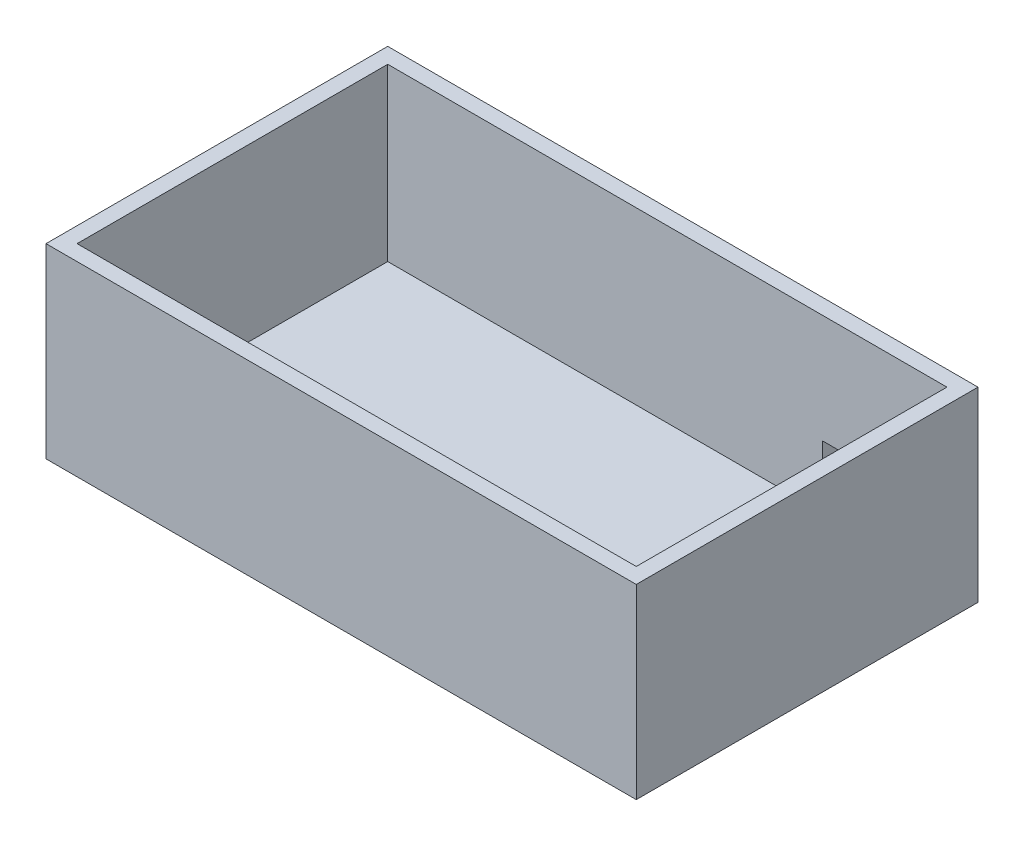
ISO-10303-21;
HEADER;
FILE_DESCRIPTION(('STEP AP214'),'2;1');
FILE_NAME('part.step','',(''),(''),'','','');
FILE_SCHEMA(('AUTOMOTIVE_DESIGN { 1 0 10303 214 1 1 1 1 }'));
ENDSEC;
DATA;
#1=APPLICATION_CONTEXT('core data for automotive mechanical design processes');
#2=APPLICATION_PROTOCOL_DEFINITION('international standard','automotive_design',2000,#1);
#3=PRODUCT_CONTEXT('',#1,'mechanical');
#4=PRODUCT('Part','Part','',(#3));
#5=PRODUCT_RELATED_PRODUCT_CATEGORY('part','',(#4));
#6=PRODUCT_DEFINITION_FORMATION('','',#4);
#7=PRODUCT_DEFINITION_CONTEXT('part definition',#1,'design');
#8=PRODUCT_DEFINITION('design','',#6,#7);
#9=PRODUCT_DEFINITION_SHAPE('','',#8);
#10=(LENGTH_UNIT() NAMED_UNIT(*) SI_UNIT(.MILLI.,.METRE.));
#11=(NAMED_UNIT(*) PLANE_ANGLE_UNIT() SI_UNIT($,.RADIAN.));
#12=(NAMED_UNIT(*) SI_UNIT($,.STERADIAN.) SOLID_ANGLE_UNIT());
#13=UNCERTAINTY_MEASURE_WITH_UNIT(LENGTH_MEASURE(1.E-05),#10,'distance_accuracy_value','');
#14=(GEOMETRIC_REPRESENTATION_CONTEXT(3) GLOBAL_UNCERTAINTY_ASSIGNED_CONTEXT((#13)) GLOBAL_UNIT_ASSIGNED_CONTEXT((#10,
#11,#12)) REPRESENTATION_CONTEXT('',''));
#15=CARTESIAN_POINT('',(0.,0.,0.));
#16=DIRECTION('',(0.,0.,1.));
#17=DIRECTION('',(1.,0.,0.));
#18=AXIS2_PLACEMENT_3D('',#15,#16,#17);
#19=CARTESIAN_POINT('',(0.,60.,0.));
#20=DIRECTION('',(0.,-1.,0.));
#21=DIRECTION('',(0.,0.,-1.));
#22=AXIS2_PLACEMENT_3D('',#19,#20,#21);
#23=PLANE('',#22);
#24=DIRECTION('',(0.,0.,1.));
#25=VECTOR('',#24,1.);
#26=CARTESIAN_POINT('',(-5.,60.,5.));
#27=LINE('',#26,#25);
#28=CARTESIAN_POINT('',(-5.,60.,-105.));
#29=VERTEX_POINT('',#28);
#30=CARTESIAN_POINT('',(-5.,60.,5.));
#31=VERTEX_POINT('',#30);
#32=EDGE_CURVE('E214',#29,#31,#27,.T.);
#33=ORIENTED_EDGE('',*,*,#32,.T.);
#34=DIRECTION('',(1.,0.,0.));
#35=VECTOR('',#34,1.);
#36=CARTESIAN_POINT('',(-5.,60.,5.));
#37=LINE('',#36,#35);
#38=CARTESIAN_POINT('',(185.,60.,5.));
#39=VERTEX_POINT('',#38);
#40=EDGE_CURVE('E218',#31,#39,#37,.T.);
#41=ORIENTED_EDGE('',*,*,#40,.T.);
#42=DIRECTION('',(0.,0.,-1.));
#43=VECTOR('',#42,1.);
#44=CARTESIAN_POINT('',(185.,60.,5.));
#45=LINE('',#44,#43);
#46=CARTESIAN_POINT('',(185.,60.,-105.));
#47=VERTEX_POINT('',#46);
#48=EDGE_CURVE('E222',#39,#47,#45,.T.);
#49=ORIENTED_EDGE('',*,*,#48,.T.);
#50=DIRECTION('',(-1.,0.,0.));
#51=VECTOR('',#50,1.);
#52=CARTESIAN_POINT('',(-5.,60.,-105.));
#53=LINE('',#52,#51);
#54=EDGE_CURVE('E225',#47,#29,#53,.T.);
#55=ORIENTED_EDGE('',*,*,#54,.T.);
#56=EDGE_LOOP('',(#33,#41,#49,#55));
#57=FACE_BOUND('',#56,.T.);
#58=DIRECTION('',(0.,0.,1.));
#59=VECTOR('',#58,1.);
#60=CARTESIAN_POINT('',(0.,60.,0.));
#61=LINE('',#60,#59);
#62=CARTESIAN_POINT('',(0.,60.,-100.));
#63=VERTEX_POINT('',#62);
#64=CARTESIAN_POINT('',(0.,60.,0.));
#65=VERTEX_POINT('',#64);
#66=EDGE_CURVE('E184',#63,#65,#61,.T.);
#67=ORIENTED_EDGE('',*,*,#66,.F.);
#68=DIRECTION('',(-1.,0.,0.));
#69=VECTOR('',#68,1.);
#70=CARTESIAN_POINT('',(0.,60.,-100.));
#71=LINE('',#70,#69);
#72=CARTESIAN_POINT('',(180.,60.,-100.));
#73=VERTEX_POINT('',#72);
#74=EDGE_CURVE('E194',#73,#63,#71,.T.);
#75=ORIENTED_EDGE('',*,*,#74,.F.);
#76=DIRECTION('',(0.,0.,-1.));
#77=VECTOR('',#76,1.);
#78=CARTESIAN_POINT('',(180.,60.,0.));
#79=LINE('',#78,#77);
#80=CARTESIAN_POINT('',(180.,60.,0.));
#81=VERTEX_POINT('',#80);
#82=EDGE_CURVE('E190',#81,#73,#79,.T.);
#83=ORIENTED_EDGE('',*,*,#82,.F.);
#84=DIRECTION('',(1.,0.,0.));
#85=VECTOR('',#84,1.);
#86=CARTESIAN_POINT('',(0.,60.,0.));
#87=LINE('',#86,#85);
#88=EDGE_CURVE('E187',#65,#81,#87,.T.);
#89=ORIENTED_EDGE('',*,*,#88,.F.);
#90=EDGE_LOOP('',(#67,#75,#83,#89));
#91=FACE_BOUND('',#90,.T.);
#92=ADVANCED_FACE('F43',(#57,#91),#23,.F.);
#93=CARTESIAN_POINT('',(0.,0.,0.));
#94=DIRECTION('',(0.,-1.,0.));
#95=DIRECTION('',(0.,0.,-1.));
#96=AXIS2_PLACEMENT_3D('',#93,#94,#95);
#97=PLANE('',#96);
#98=DIRECTION('',(0.,0.,1.));
#99=VECTOR('',#98,1.);
#100=CARTESIAN_POINT('',(-5.,0.,5.));
#101=LINE('',#100,#99);
#102=CARTESIAN_POINT('',(-5.,0.,-105.));
#103=VERTEX_POINT('',#102);
#104=CARTESIAN_POINT('',(-5.,0.,5.));
#105=VERTEX_POINT('',#104);
#106=EDGE_CURVE('E213',#103,#105,#101,.T.);
#107=ORIENTED_EDGE('',*,*,#106,.F.);
#108=DIRECTION('',(-1.,0.,0.));
#109=VECTOR('',#108,1.);
#110=CARTESIAN_POINT('',(-5.,0.,-105.));
#111=LINE('',#110,#109);
#112=CARTESIAN_POINT('',(185.,0.,-105.));
#113=VERTEX_POINT('',#112);
#114=EDGE_CURVE('E219',#113,#103,#111,.T.);
#115=ORIENTED_EDGE('',*,*,#114,.F.);
#116=DIRECTION('',(0.,0.,-1.));
#117=VECTOR('',#116,1.);
#118=CARTESIAN_POINT('',(185.,0.,5.));
#119=LINE('',#118,#117);
#120=CARTESIAN_POINT('',(185.,0.,5.));
#121=VERTEX_POINT('',#120);
#122=EDGE_CURVE('E236',#121,#113,#119,.T.);
#123=ORIENTED_EDGE('',*,*,#122,.F.);
#124=DIRECTION('',(1.,0.,0.));
#125=VECTOR('',#124,1.);
#126=CARTESIAN_POINT('',(-5.,0.,5.));
#127=LINE('',#126,#125);
#128=EDGE_CURVE('E232',#105,#121,#127,.T.);
#129=ORIENTED_EDGE('',*,*,#128,.F.);
#130=EDGE_LOOP('',(#107,#115,#123,#129));
#131=FACE_BOUND('',#130,.T.);
#132=ADVANCED_FACE('F289',(#131),#97,.T.);
#133=CARTESIAN_POINT('',(-5.,60.,5.));
#134=DIRECTION('',(1.,0.,0.));
#135=DIRECTION('',(0.,0.,-1.));
#136=AXIS2_PLACEMENT_3D('',#133,#134,#135);
#137=PLANE('',#136);
#138=DIRECTION('',(0.,-1.,0.));
#139=VECTOR('',#138,1.);
#140=CARTESIAN_POINT('',(-5.,60.,-105.));
#141=LINE('',#140,#139);
#142=EDGE_CURVE('E228',#29,#103,#141,.T.);
#143=ORIENTED_EDGE('',*,*,#142,.T.);
#144=ORIENTED_EDGE('',*,*,#106,.T.);
#145=DIRECTION('',(0.,-1.,0.));
#146=VECTOR('',#145,1.);
#147=CARTESIAN_POINT('',(-5.,60.,5.));
#148=LINE('',#147,#146);
#149=EDGE_CURVE('E251',#31,#105,#148,.T.);
#150=ORIENTED_EDGE('',*,*,#149,.F.);
#151=ORIENTED_EDGE('',*,*,#32,.F.);
#152=EDGE_LOOP('',(#143,#144,#150,#151));
#153=FACE_BOUND('',#152,.T.);
#154=ADVANCED_FACE('F45',(#153),#137,.F.);
#155=CARTESIAN_POINT('',(-5.,60.,5.));
#156=DIRECTION('',(0.,0.,-1.));
#157=DIRECTION('',(-1.,0.,0.));
#158=AXIS2_PLACEMENT_3D('',#155,#156,#157);
#159=PLANE('',#158);
#160=ORIENTED_EDGE('',*,*,#149,.T.);
#161=ORIENTED_EDGE('',*,*,#128,.T.);
#162=DIRECTION('',(0.,-1.,0.));
#163=VECTOR('',#162,1.);
#164=CARTESIAN_POINT('',(185.,60.,5.));
#165=LINE('',#164,#163);
#166=EDGE_CURVE('E248',#39,#121,#165,.T.);
#167=ORIENTED_EDGE('',*,*,#166,.F.);
#168=ORIENTED_EDGE('',*,*,#40,.F.);
#169=EDGE_LOOP('',(#160,#161,#167,#168));
#170=FACE_BOUND('',#169,.T.);
#171=ADVANCED_FACE('F304',(#170),#159,.F.);
#172=CARTESIAN_POINT('',(185.,60.,5.));
#173=DIRECTION('',(-1.,0.,0.));
#174=DIRECTION('',(0.,0.,1.));
#175=AXIS2_PLACEMENT_3D('',#172,#173,#174);
#176=PLANE('',#175);
#177=ORIENTED_EDGE('',*,*,#166,.T.);
#178=ORIENTED_EDGE('',*,*,#122,.T.);
#179=DIRECTION('',(0.,-1.,0.));
#180=VECTOR('',#179,1.);
#181=CARTESIAN_POINT('',(185.,60.,-105.));
#182=LINE('',#181,#180);
#183=EDGE_CURVE('E245',#47,#113,#182,.T.);
#184=ORIENTED_EDGE('',*,*,#183,.F.);
#185=ORIENTED_EDGE('',*,*,#48,.F.);
#186=EDGE_LOOP('',(#177,#178,#184,#185));
#187=FACE_BOUND('',#186,.T.);
#188=ADVANCED_FACE('F302',(#187),#176,.F.);
#189=CARTESIAN_POINT('',(-5.,60.,-105.));
#190=DIRECTION('',(0.,0.,1.));
#191=DIRECTION('',(1.,0.,0.));
#192=AXIS2_PLACEMENT_3D('',#189,#190,#191);
#193=PLANE('',#192);
#194=DIRECTION('',(-1.,0.,0.));
#195=VECTOR('',#194,1.);
#196=CARTESIAN_POINT('',(165.,5.,-105.));
#197=LINE('',#196,#195);
#198=CARTESIAN_POINT('',(165.,5.,-105.));
#199=VERTEX_POINT('',#198);
#200=CARTESIAN_POINT('',(140.,5.,-105.));
#201=VERTEX_POINT('',#200);
#202=EDGE_CURVE('E144',#199,#201,#197,.T.);
#203=ORIENTED_EDGE('',*,*,#202,.F.);
#204=DIRECTION('',(0.,-1.,0.));
#205=VECTOR('',#204,1.);
#206=CARTESIAN_POINT('',(165.,25.,-105.));
#207=LINE('',#206,#205);
#208=CARTESIAN_POINT('',(165.,25.,-105.));
#209=VERTEX_POINT('',#208);
#210=EDGE_CURVE('E59',#209,#199,#207,.T.);
#211=ORIENTED_EDGE('',*,*,#210,.F.);
#212=DIRECTION('',(1.,0.,0.));
#213=VECTOR('',#212,1.);
#214=CARTESIAN_POINT('',(165.,25.,-105.));
#215=LINE('',#214,#213);
#216=CARTESIAN_POINT('',(140.,25.,-105.));
#217=VERTEX_POINT('',#216);
#218=EDGE_CURVE('E153',#217,#209,#215,.T.);
#219=ORIENTED_EDGE('',*,*,#218,.F.);
#220=DIRECTION('',(0.,1.,0.));
#221=VECTOR('',#220,1.);
#222=CARTESIAN_POINT('',(140.,25.,-105.));
#223=LINE('',#222,#221);
#224=EDGE_CURVE('E134',#201,#217,#223,.T.);
#225=ORIENTED_EDGE('',*,*,#224,.F.);
#226=EDGE_LOOP('',(#203,#211,#219,#225));
#227=FACE_BOUND('',#226,.T.);
#228=ORIENTED_EDGE('',*,*,#183,.T.);
#229=ORIENTED_EDGE('',*,*,#114,.T.);
#230=ORIENTED_EDGE('',*,*,#142,.F.);
#231=ORIENTED_EDGE('',*,*,#54,.F.);
#232=EDGE_LOOP('',(#228,#229,#230,#231));
#233=FACE_BOUND('',#232,.T.);
#234=ADVANCED_FACE('F150',(#227,#233),#193,.F.);
#235=CARTESIAN_POINT('',(0.,60.,0.));
#236=DIRECTION('',(1.,0.,0.));
#237=DIRECTION('',(0.,0.,-1.));
#238=AXIS2_PLACEMENT_3D('',#235,#236,#237);
#239=PLANE('',#238);
#240=DIRECTION('',(0.,0.,1.));
#241=VECTOR('',#240,1.);
#242=CARTESIAN_POINT('',(0.,5.,0.));
#243=LINE('',#242,#241);
#244=CARTESIAN_POINT('',(0.,5.,-100.));
#245=VERTEX_POINT('',#244);
#246=CARTESIAN_POINT('',(0.,5.,0.));
#247=VERTEX_POINT('',#246);
#248=EDGE_CURVE('E180',#245,#247,#243,.T.);
#249=ORIENTED_EDGE('',*,*,#248,.F.);
#250=DIRECTION('',(0.,-1.,0.));
#251=VECTOR('',#250,1.);
#252=CARTESIAN_POINT('',(0.,60.,-100.));
#253=LINE('',#252,#251);
#254=EDGE_CURVE('E197',#63,#245,#253,.T.);
#255=ORIENTED_EDGE('',*,*,#254,.F.);
#256=ORIENTED_EDGE('',*,*,#66,.T.);
#257=DIRECTION('',(0.,-1.,0.));
#258=VECTOR('',#257,1.);
#259=CARTESIAN_POINT('',(0.,60.,0.));
#260=LINE('',#259,#258);
#261=EDGE_CURVE('E209',#65,#247,#260,.T.);
#262=ORIENTED_EDGE('',*,*,#261,.T.);
#263=EDGE_LOOP('',(#249,#255,#256,#262));
#264=FACE_BOUND('',#263,.T.);
#265=ADVANCED_FACE('F264',(#264),#239,.T.);
#266=CARTESIAN_POINT('',(0.,60.,0.));
#267=DIRECTION('',(0.,0.,-1.));
#268=DIRECTION('',(-1.,0.,0.));
#269=AXIS2_PLACEMENT_3D('',#266,#267,#268);
#270=PLANE('',#269);
#271=DIRECTION('',(1.,0.,0.));
#272=VECTOR('',#271,1.);
#273=CARTESIAN_POINT('',(0.,5.,0.));
#274=LINE('',#273,#272);
#275=CARTESIAN_POINT('',(180.,5.,0.));
#276=VERTEX_POINT('',#275);
#277=EDGE_CURVE('E176',#247,#276,#274,.T.);
#278=ORIENTED_EDGE('',*,*,#277,.F.);
#279=ORIENTED_EDGE('',*,*,#261,.F.);
#280=ORIENTED_EDGE('',*,*,#88,.T.);
#281=DIRECTION('',(0.,-1.,0.));
#282=VECTOR('',#281,1.);
#283=CARTESIAN_POINT('',(180.,60.,0.));
#284=LINE('',#283,#282);
#285=EDGE_CURVE('E205',#81,#276,#284,.T.);
#286=ORIENTED_EDGE('',*,*,#285,.T.);
#287=EDGE_LOOP('',(#278,#279,#280,#286));
#288=FACE_BOUND('',#287,.T.);
#289=ADVANCED_FACE('F268',(#288),#270,.T.);
#290=CARTESIAN_POINT('',(180.,60.,0.));
#291=DIRECTION('',(-1.,0.,0.));
#292=DIRECTION('',(0.,0.,1.));
#293=AXIS2_PLACEMENT_3D('',#290,#291,#292);
#294=PLANE('',#293);
#295=DIRECTION('',(0.,0.,-1.));
#296=VECTOR('',#295,1.);
#297=CARTESIAN_POINT('',(180.,5.,0.));
#298=LINE('',#297,#296);
#299=CARTESIAN_POINT('',(180.,5.,-100.));
#300=VERTEX_POINT('',#299);
#301=EDGE_CURVE('E172',#276,#300,#298,.T.);
#302=ORIENTED_EDGE('',*,*,#301,.F.);
#303=ORIENTED_EDGE('',*,*,#285,.F.);
#304=ORIENTED_EDGE('',*,*,#82,.T.);
#305=DIRECTION('',(0.,-1.,0.));
#306=VECTOR('',#305,1.);
#307=CARTESIAN_POINT('',(180.,60.,-100.));
#308=LINE('',#307,#306);
#309=EDGE_CURVE('E201',#73,#300,#308,.T.);
#310=ORIENTED_EDGE('',*,*,#309,.T.);
#311=EDGE_LOOP('',(#302,#303,#304,#310));
#312=FACE_BOUND('',#311,.T.);
#313=ADVANCED_FACE('F273',(#312),#294,.T.);
#314=CARTESIAN_POINT('',(0.,60.,-100.));
#315=DIRECTION('',(0.,0.,1.));
#316=DIRECTION('',(1.,0.,0.));
#317=AXIS2_PLACEMENT_3D('',#314,#315,#316);
#318=PLANE('',#317);
#319=DIRECTION('',(0.,1.,0.));
#320=VECTOR('',#319,1.);
#321=CARTESIAN_POINT('',(165.,60.,-100.));
#322=LINE('',#321,#320);
#323=CARTESIAN_POINT('',(165.,5.,-100.));
#324=VERTEX_POINT('',#323);
#325=CARTESIAN_POINT('',(165.,25.,-100.));
#326=VERTEX_POINT('',#325);
#327=EDGE_CURVE('E169',#324,#326,#322,.T.);
#328=ORIENTED_EDGE('',*,*,#327,.F.);
#329=DIRECTION('',(-1.,0.,0.));
#330=VECTOR('',#329,1.);
#331=CARTESIAN_POINT('',(0.,5.,-100.));
#332=LINE('',#331,#330);
#333=EDGE_CURVE('E52',#300,#324,#332,.T.);
#334=ORIENTED_EDGE('',*,*,#333,.F.);
#335=ORIENTED_EDGE('',*,*,#309,.F.);
#336=ORIENTED_EDGE('',*,*,#74,.T.);
#337=ORIENTED_EDGE('',*,*,#254,.T.);
#338=CARTESIAN_POINT('',(140.,5.,-100.));
#339=VERTEX_POINT('',#338);
#340=EDGE_CURVE('E253',#339,#245,#332,.T.);
#341=ORIENTED_EDGE('',*,*,#340,.F.);
#342=DIRECTION('',(0.,-1.,0.));
#343=VECTOR('',#342,1.);
#344=CARTESIAN_POINT('',(140.,60.,-100.));
#345=LINE('',#344,#343);
#346=CARTESIAN_POINT('',(140.,25.,-100.));
#347=VERTEX_POINT('',#346);
#348=EDGE_CURVE('E137',#347,#339,#345,.T.);
#349=ORIENTED_EDGE('',*,*,#348,.F.);
#350=DIRECTION('',(-1.,0.,0.));
#351=VECTOR('',#350,1.);
#352=CARTESIAN_POINT('',(0.,25.,-100.));
#353=LINE('',#352,#351);
#354=EDGE_CURVE('E11',#326,#347,#353,.T.);
#355=ORIENTED_EDGE('',*,*,#354,.F.);
#356=EDGE_LOOP('',(#328,#334,#335,#336,#337,#341,#349,#355));
#357=FACE_BOUND('',#356,.T.);
#358=ADVANCED_FACE('F260',(#357),#318,.T.);
#359=CARTESIAN_POINT('',(-115.113577727726,5.,5.));
#360=DIRECTION('',(0.,1.,0.));
#361=DIRECTION('',(0.,0.,1.));
#362=AXIS2_PLACEMENT_3D('',#359,#360,#361);
#363=PLANE('',#362);
#364=ORIENTED_EDGE('',*,*,#333,.T.);
#365=DIRECTION('',(0.,0.,-1.));
#366=VECTOR('',#365,1.);
#367=CARTESIAN_POINT('',(165.,5.,-45.));
#368=LINE('',#367,#366);
#369=EDGE_CURVE('E141',#324,#199,#368,.T.);
#370=ORIENTED_EDGE('',*,*,#369,.T.);
#371=ORIENTED_EDGE('',*,*,#202,.T.);
#372=DIRECTION('',(0.,0.,-1.));
#373=VECTOR('',#372,1.);
#374=CARTESIAN_POINT('',(140.,5.,-45.));
#375=LINE('',#374,#373);
#376=EDGE_CURVE('E67',#339,#201,#375,.T.);
#377=ORIENTED_EDGE('',*,*,#376,.F.);
#378=ORIENTED_EDGE('',*,*,#340,.T.);
#379=ORIENTED_EDGE('',*,*,#248,.T.);
#380=ORIENTED_EDGE('',*,*,#277,.T.);
#381=ORIENTED_EDGE('',*,*,#301,.T.);
#382=EDGE_LOOP('',(#364,#370,#371,#377,#378,#379,#380,#381));
#383=FACE_BOUND('',#382,.T.);
#384=ADVANCED_FACE('F146',(#383),#363,.T.);
#385=CARTESIAN_POINT('',(165.,25.,-45.));
#386=DIRECTION('',(1.,0.,0.));
#387=DIRECTION('',(0.,0.,-1.));
#388=AXIS2_PLACEMENT_3D('',#385,#386,#387);
#389=PLANE('',#388);
#390=ORIENTED_EDGE('',*,*,#327,.T.);
#391=DIRECTION('',(0.,0.,-1.));
#392=VECTOR('',#391,1.);
#393=CARTESIAN_POINT('',(165.,25.,-45.));
#394=LINE('',#393,#392);
#395=EDGE_CURVE('E160',#326,#209,#394,.T.);
#396=ORIENTED_EDGE('',*,*,#395,.T.);
#397=ORIENTED_EDGE('',*,*,#210,.T.);
#398=ORIENTED_EDGE('',*,*,#369,.F.);
#399=EDGE_LOOP('',(#390,#396,#397,#398));
#400=FACE_BOUND('',#399,.T.);
#401=ADVANCED_FACE('F276',(#400),#389,.F.);
#402=CARTESIAN_POINT('',(165.,25.,-45.));
#403=DIRECTION('',(0.,1.,0.));
#404=DIRECTION('',(0.,0.,1.));
#405=AXIS2_PLACEMENT_3D('',#402,#403,#404);
#406=PLANE('',#405);
#407=ORIENTED_EDGE('',*,*,#354,.T.);
#408=DIRECTION('',(0.,0.,-1.));
#409=VECTOR('',#408,1.);
#410=CARTESIAN_POINT('',(140.,25.,-45.));
#411=LINE('',#410,#409);
#412=EDGE_CURVE('E140',#347,#217,#411,.T.);
#413=ORIENTED_EDGE('',*,*,#412,.T.);
#414=ORIENTED_EDGE('',*,*,#218,.T.);
#415=ORIENTED_EDGE('',*,*,#395,.F.);
#416=EDGE_LOOP('',(#407,#413,#414,#415));
#417=FACE_BOUND('',#416,.T.);
#418=ADVANCED_FACE('F278',(#417),#406,.F.);
#419=CARTESIAN_POINT('',(140.,25.,-45.));
#420=DIRECTION('',(-1.,0.,0.));
#421=DIRECTION('',(0.,0.,1.));
#422=AXIS2_PLACEMENT_3D('',#419,#420,#421);
#423=PLANE('',#422);
#424=ORIENTED_EDGE('',*,*,#348,.T.);
#425=ORIENTED_EDGE('',*,*,#376,.T.);
#426=ORIENTED_EDGE('',*,*,#224,.T.);
#427=ORIENTED_EDGE('',*,*,#412,.F.);
#428=EDGE_LOOP('',(#424,#425,#426,#427));
#429=FACE_BOUND('',#428,.T.);
#430=ADVANCED_FACE('F131',(#429),#423,.F.);
#431=CLOSED_SHELL('',(#92,#132,#154,#171,#188,#234,#265,#289,#313,#358,#384,#401,#418,#430));
#432=MANIFOLD_SOLID_BREP('B2',#431);
#433=ADVANCED_BREP_SHAPE_REPRESENTATION('',(#18,#432),#14);
#434=SHAPE_DEFINITION_REPRESENTATION(#9,#433);
ENDSEC;
END-ISO-10303-21;
